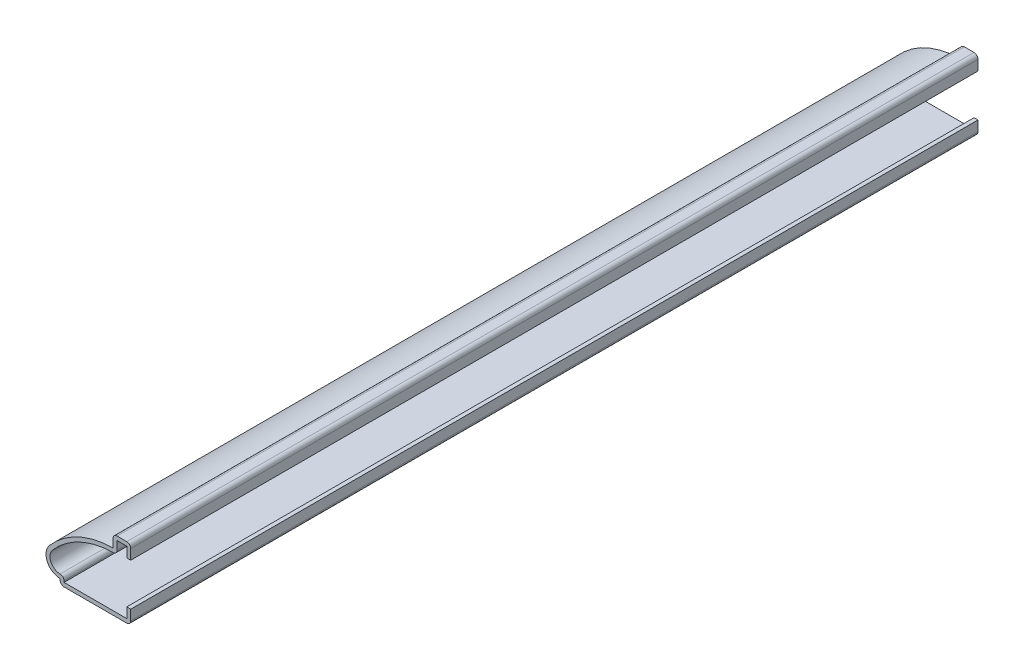
ISO-10303-21;
HEADER;
FILE_DESCRIPTION(('STEP AP214'),'2;1');
FILE_NAME('part.step','',(''),(''),'','','');
FILE_SCHEMA(('AUTOMOTIVE_DESIGN { 1 0 10303 214 1 1 1 1 }'));
ENDSEC;
DATA;
#1=APPLICATION_CONTEXT('core data for automotive mechanical design processes');
#2=APPLICATION_PROTOCOL_DEFINITION('international standard','automotive_design',2000,#1);
#3=PRODUCT_CONTEXT('',#1,'mechanical');
#4=PRODUCT('Part','Part','',(#3));
#5=PRODUCT_RELATED_PRODUCT_CATEGORY('part','',(#4));
#6=PRODUCT_DEFINITION_FORMATION('','',#4);
#7=PRODUCT_DEFINITION_CONTEXT('part definition',#1,'design');
#8=PRODUCT_DEFINITION('design','',#6,#7);
#9=PRODUCT_DEFINITION_SHAPE('','',#8);
#10=(LENGTH_UNIT() NAMED_UNIT(*) SI_UNIT(.MILLI.,.METRE.));
#11=(NAMED_UNIT(*) PLANE_ANGLE_UNIT() SI_UNIT($,.RADIAN.));
#12=(NAMED_UNIT(*) SI_UNIT($,.STERADIAN.) SOLID_ANGLE_UNIT());
#13=UNCERTAINTY_MEASURE_WITH_UNIT(LENGTH_MEASURE(1.E-05),#10,'distance_accuracy_value','');
#14=(GEOMETRIC_REPRESENTATION_CONTEXT(3) GLOBAL_UNCERTAINTY_ASSIGNED_CONTEXT((#13)) GLOBAL_UNIT_ASSIGNED_CONTEXT((#10,
#11,#12)) REPRESENTATION_CONTEXT('',''));
#15=CARTESIAN_POINT('',(0.,0.,0.));
#16=DIRECTION('',(0.,0.,1.));
#17=DIRECTION('',(1.,0.,0.));
#18=AXIS2_PLACEMENT_3D('',#15,#16,#17);
#19=CARTESIAN_POINT('',(-0.889,12.7,-190.5));
#20=DIRECTION('',(-1.,0.,0.));
#21=DIRECTION('',(0.,-1.,0.));
#22=AXIS2_PLACEMENT_3D('',#19,#20,#21);
#23=PLANE('',#22);
#24=DIRECTION('',(0.,-1.,0.));
#25=VECTOR('',#24,1.);
#26=CARTESIAN_POINT('',(-0.889,12.7,0.));
#27=LINE('',#26,#25);
#28=CARTESIAN_POINT('',(-0.889,11.811,0.));
#29=VERTEX_POINT('',#28);
#30=CARTESIAN_POINT('',(-0.888999999999999,9.525,0.));
#31=VERTEX_POINT('',#30);
#32=EDGE_CURVE('E264',#29,#31,#27,.T.);
#33=ORIENTED_EDGE('',*,*,#32,.F.);
#34=DIRECTION('',(0.,0.,1.));
#35=VECTOR('',#34,1.);
#36=CARTESIAN_POINT('',(-0.889,11.811,-190.5));
#37=LINE('',#36,#35);
#38=CARTESIAN_POINT('',(-0.889,11.811,-190.5));
#39=VERTEX_POINT('',#38);
#40=EDGE_CURVE('E221',#39,#29,#37,.T.);
#41=ORIENTED_EDGE('',*,*,#40,.F.);
#42=DIRECTION('',(0.,-1.,0.));
#43=VECTOR('',#42,1.);
#44=CARTESIAN_POINT('',(-0.889,12.7,-190.5));
#45=LINE('',#44,#43);
#46=CARTESIAN_POINT('',(-0.888999999999999,9.525,-190.5));
#47=VERTEX_POINT('',#46);
#48=EDGE_CURVE('E203',#39,#47,#45,.T.);
#49=ORIENTED_EDGE('',*,*,#48,.T.);
#50=DIRECTION('',(0.,0.,1.));
#51=VECTOR('',#50,1.);
#52=CARTESIAN_POINT('',(-0.888999999999999,9.525,-190.5));
#53=LINE('',#52,#51);
#54=EDGE_CURVE('E211',#47,#31,#53,.T.);
#55=ORIENTED_EDGE('',*,*,#54,.T.);
#56=EDGE_LOOP('',(#33,#41,#49,#55));
#57=FACE_BOUND('',#56,.T.);
#58=ADVANCED_FACE('F35',(#57),#23,.T.);
#59=CARTESIAN_POINT('',(-3.96875,11.811,-190.5));
#60=DIRECTION('',(0.,-1.,0.));
#61=DIRECTION('',(0.,0.,-1.));
#62=AXIS2_PLACEMENT_3D('',#59,#60,#61);
#63=PLANE('',#62);
#64=DIRECTION('',(1.,0.,0.));
#65=VECTOR('',#64,1.);
#66=CARTESIAN_POINT('',(-3.96875,11.811,0.));
#67=LINE('',#66,#65);
#68=CARTESIAN_POINT('',(-3.07975,11.811,0.));
#69=VERTEX_POINT('',#68);
#70=EDGE_CURVE('E222',#69,#29,#67,.T.);
#71=ORIENTED_EDGE('',*,*,#70,.F.);
#72=DIRECTION('',(0.,0.,1.));
#73=VECTOR('',#72,1.);
#74=CARTESIAN_POINT('',(-3.07975,11.811,-190.5));
#75=LINE('',#74,#73);
#76=CARTESIAN_POINT('',(-3.07975,11.811,-190.5));
#77=VERTEX_POINT('',#76);
#78=EDGE_CURVE('E305',#77,#69,#75,.T.);
#79=ORIENTED_EDGE('',*,*,#78,.F.);
#80=DIRECTION('',(1.,0.,0.));
#81=VECTOR('',#80,1.);
#82=CARTESIAN_POINT('',(-3.96875,11.811,-190.5));
#83=LINE('',#82,#81);
#84=EDGE_CURVE('E219',#77,#39,#83,.T.);
#85=ORIENTED_EDGE('',*,*,#84,.T.);
#86=ORIENTED_EDGE('',*,*,#40,.T.);
#87=EDGE_LOOP('',(#71,#79,#85,#86));
#88=FACE_BOUND('',#87,.T.);
#89=ADVANCED_FACE('F400',(#88),#63,.T.);
#90=CARTESIAN_POINT('',(-3.07975,9.921875,-190.5));
#91=DIRECTION('',(1.,0.,0.));
#92=DIRECTION('',(0.,0.,-1.));
#93=AXIS2_PLACEMENT_3D('',#90,#91,#92);
#94=PLANE('',#93);
#95=DIRECTION('',(0.,1.,0.));
#96=VECTOR('',#95,1.);
#97=CARTESIAN_POINT('',(-3.07975,9.921875,0.));
#98=LINE('',#97,#96);
#99=CARTESIAN_POINT('',(-3.07975,9.92187500000001,0.));
#100=VERTEX_POINT('',#99);
#101=EDGE_CURVE('E225',#100,#69,#98,.T.);
#102=ORIENTED_EDGE('',*,*,#101,.F.);
#103=DIRECTION('',(0.,0.,1.));
#104=VECTOR('',#103,1.);
#105=CARTESIAN_POINT('',(-3.07975,9.921875,-190.5));
#106=LINE('',#105,#104);
#107=CARTESIAN_POINT('',(-3.07975,9.92187500000001,-190.5));
#108=VERTEX_POINT('',#107);
#109=EDGE_CURVE('E370',#100,#108,#106,.F.);
#110=ORIENTED_EDGE('',*,*,#109,.T.);
#111=DIRECTION('',(0.,1.,0.));
#112=VECTOR('',#111,1.);
#113=CARTESIAN_POINT('',(-3.07975,9.921875,-190.5));
#114=LINE('',#113,#112);
#115=EDGE_CURVE('E261',#108,#77,#114,.T.);
#116=ORIENTED_EDGE('',*,*,#115,.T.);
#117=ORIENTED_EDGE('',*,*,#78,.T.);
#118=EDGE_LOOP('',(#102,#110,#116,#117));
#119=FACE_BOUND('',#118,.T.);
#120=ADVANCED_FACE('F481',(#119),#94,.T.);
#121=CARTESIAN_POINT('',(-3.81048213585267,-9.12746754201909,-190.5));
#122=DIRECTION('',(0.,0.,1.));
#123=DIRECTION('',(1.,0.,0.));
#124=AXIS2_PLACEMENT_3D('',#121,#122,#123);
#125=CYLINDRICAL_SURFACE('',#124,18.161);
#126=CARTESIAN_POINT('',(-3.81048213585267,-9.12746754201909,-190.5));
#127=DIRECTION('',(0.,0.,1.));
#128=DIRECTION('',(1.,0.,0.));
#129=AXIS2_PLACEMENT_3D('',#126,#127,#128);
#130=CIRCLE('',#129,18.161);
#131=CARTESIAN_POINT('',(-17.6122905724372,2.67643032605075,-190.5));
#132=VERTEX_POINT('',#131);
#133=CARTESIAN_POINT('',(-3.96136416633979,9.03290568137245,-190.5));
#134=VERTEX_POINT('',#133);
#135=EDGE_CURVE('E258',#132,#134,#130,.F.);
#136=ORIENTED_EDGE('',*,*,#135,.T.);
#137=DIRECTION('',(0.,0.,1.));
#138=VECTOR('',#137,1.);
#139=CARTESIAN_POINT('',(-3.96136416633979,9.03290568137245,-190.5));
#140=LINE('',#139,#138);
#141=CARTESIAN_POINT('',(-3.96136416633979,9.03290568137245,0.));
#142=VERTEX_POINT('',#141);
#143=EDGE_CURVE('E367',#134,#142,#140,.T.);
#144=ORIENTED_EDGE('',*,*,#143,.T.);
#145=CARTESIAN_POINT('',(-3.81048213585267,-9.12746754201909,0.));
#146=DIRECTION('',(0.,0.,1.));
#147=DIRECTION('',(1.,0.,0.));
#148=AXIS2_PLACEMENT_3D('',#145,#146,#147);
#149=CIRCLE('',#148,18.161);
#150=CARTESIAN_POINT('',(-17.6122905724372,2.67643032605075,0.));
#151=VERTEX_POINT('',#150);
#152=EDGE_CURVE('E299',#151,#142,#149,.F.);
#153=ORIENTED_EDGE('',*,*,#152,.F.);
#154=DIRECTION('',(0.,0.,1.));
#155=VECTOR('',#154,1.);
#156=CARTESIAN_POINT('',(-17.6122905724372,2.67643032605075,-190.5));
#157=LINE('',#156,#155);
#158=EDGE_CURVE('E308',#132,#151,#157,.T.);
#159=ORIENTED_EDGE('',*,*,#158,.F.);
#160=EDGE_LOOP('',(#136,#144,#153,#159));
#161=FACE_BOUND('',#160,.T.);
#162=ADVANCED_FACE('F411',(#161),#125,.F.);
#163=CARTESIAN_POINT('',(-15.875,1.190625,-190.5));
#164=DIRECTION('',(0.,0.,1.));
#165=DIRECTION('',(1.,0.,0.));
#166=AXIS2_PLACEMENT_3D('',#163,#164,#165);
#167=CYLINDRICAL_SURFACE('',#166,2.286);
#168=CARTESIAN_POINT('',(-15.875,1.190625,0.));
#169=DIRECTION('',(0.,0.,1.));
#170=DIRECTION('',(1.,0.,0.));
#171=AXIS2_PLACEMENT_3D('',#168,#169,#170);
#172=CIRCLE('',#171,2.286);
#173=CARTESIAN_POINT('',(-15.875,-1.09537500000001,0.));
#174=VERTEX_POINT('',#173);
#175=EDGE_CURVE('E297',#174,#151,#172,.F.);
#176=ORIENTED_EDGE('',*,*,#175,.F.);
#177=DIRECTION('',(0.,0.,1.));
#178=VECTOR('',#177,1.);
#179=CARTESIAN_POINT('',(-15.875,-1.09537500000001,-190.5));
#180=LINE('',#179,#178);
#181=CARTESIAN_POINT('',(-15.875,-1.09537500000001,-190.5));
#182=VERTEX_POINT('',#181);
#183=EDGE_CURVE('E365',#174,#182,#180,.F.);
#184=ORIENTED_EDGE('',*,*,#183,.T.);
#185=CARTESIAN_POINT('',(-15.875,1.190625,-190.5));
#186=DIRECTION('',(0.,0.,1.));
#187=DIRECTION('',(1.,0.,0.));
#188=AXIS2_PLACEMENT_3D('',#185,#186,#187);
#189=CIRCLE('',#188,2.286);
#190=EDGE_CURVE('E256',#182,#132,#189,.F.);
#191=ORIENTED_EDGE('',*,*,#190,.T.);
#192=ORIENTED_EDGE('',*,*,#158,.T.);
#193=EDGE_LOOP('',(#176,#184,#191,#192));
#194=FACE_BOUND('',#193,.T.);
#195=ADVANCED_FACE('F416',(#194),#167,.F.);
#196=CARTESIAN_POINT('',(-14.986,-3.175,-190.5));
#197=DIRECTION('',(1.,0.,0.));
#198=DIRECTION('',(0.,0.,-1.));
#199=AXIS2_PLACEMENT_3D('',#196,#197,#198);
#200=PLANE('',#199);
#201=DIRECTION('',(0.,1.,0.));
#202=VECTOR('',#201,1.);
#203=CARTESIAN_POINT('',(-14.986,-3.175,-190.5));
#204=LINE('',#203,#202);
#205=CARTESIAN_POINT('',(-14.986,-2.286,-190.5));
#206=VERTEX_POINT('',#205);
#207=CARTESIAN_POINT('',(-14.986,-1.98437500000001,-190.5));
#208=VERTEX_POINT('',#207);
#209=EDGE_CURVE('E253',#206,#208,#204,.T.);
#210=ORIENTED_EDGE('',*,*,#209,.T.);
#211=DIRECTION('',(0.,0.,1.));
#212=VECTOR('',#211,1.);
#213=CARTESIAN_POINT('',(-14.986,-1.98437500000001,-190.5));
#214=LINE('',#213,#212);
#215=CARTESIAN_POINT('',(-14.986,-1.98437500000001,0.));
#216=VERTEX_POINT('',#215);
#217=EDGE_CURVE('E362',#208,#216,#214,.T.);
#218=ORIENTED_EDGE('',*,*,#217,.T.);
#219=DIRECTION('',(0.,1.,0.));
#220=VECTOR('',#219,1.);
#221=CARTESIAN_POINT('',(-14.986,-3.175,0.));
#222=LINE('',#221,#220);
#223=CARTESIAN_POINT('',(-14.986,-2.286,0.));
#224=VERTEX_POINT('',#223);
#225=EDGE_CURVE('E294',#224,#216,#222,.T.);
#226=ORIENTED_EDGE('',*,*,#225,.F.);
#227=DIRECTION('',(0.,0.,1.));
#228=VECTOR('',#227,1.);
#229=CARTESIAN_POINT('',(-14.986,-2.286,-190.5));
#230=LINE('',#229,#228);
#231=EDGE_CURVE('E311',#206,#224,#230,.T.);
#232=ORIENTED_EDGE('',*,*,#231,.F.);
#233=EDGE_LOOP('',(#210,#218,#226,#232));
#234=FACE_BOUND('',#233,.T.);
#235=ADVANCED_FACE('F425',(#234),#200,.T.);
#236=CARTESIAN_POINT('',(0.,-2.286,-190.5));
#237=DIRECTION('',(0.,1.,0.));
#238=DIRECTION('',(-1.,0.,0.));
#239=AXIS2_PLACEMENT_3D('',#236,#237,#238);
#240=PLANE('',#239);
#241=DIRECTION('',(-1.,0.,0.));
#242=VECTOR('',#241,1.);
#243=CARTESIAN_POINT('',(0.,-2.286,0.));
#244=LINE('',#243,#242);
#245=CARTESIAN_POINT('',(-0.889,-2.286,0.));
#246=VERTEX_POINT('',#245);
#247=EDGE_CURVE('E291',#246,#224,#244,.T.);
#248=ORIENTED_EDGE('',*,*,#247,.F.);
#249=DIRECTION('',(0.,0.,1.));
#250=VECTOR('',#249,1.);
#251=CARTESIAN_POINT('',(-0.889,-2.286,-190.5));
#252=LINE('',#251,#250);
#253=CARTESIAN_POINT('',(-0.889,-2.286,-190.5));
#254=VERTEX_POINT('',#253);
#255=EDGE_CURVE('E313',#254,#246,#252,.T.);
#256=ORIENTED_EDGE('',*,*,#255,.F.);
#257=DIRECTION('',(-1.,0.,0.));
#258=VECTOR('',#257,1.);
#259=CARTESIAN_POINT('',(0.,-2.286,-190.5));
#260=LINE('',#259,#258);
#261=EDGE_CURVE('E250',#254,#206,#260,.T.);
#262=ORIENTED_EDGE('',*,*,#261,.T.);
#263=ORIENTED_EDGE('',*,*,#231,.T.);
#264=EDGE_LOOP('',(#248,#256,#262,#263));
#265=FACE_BOUND('',#264,.T.);
#266=ADVANCED_FACE('F430',(#265),#240,.T.);
#267=CARTESIAN_POINT('',(-0.889,0.,-190.5));
#268=DIRECTION('',(-1.,0.,0.));
#269=DIRECTION('',(0.,0.,1.));
#270=AXIS2_PLACEMENT_3D('',#267,#268,#269);
#271=PLANE('',#270);
#272=DIRECTION('',(0.,1.,0.));
#273=VECTOR('',#272,1.);
#274=CARTESIAN_POINT('',(-0.889,0.,0.));
#275=LINE('',#274,#273);
#276=CARTESIAN_POINT('',(-0.889,0.,0.));
#277=VERTEX_POINT('',#276);
#278=EDGE_CURVE('E288',#277,#246,#275,.F.);
#279=ORIENTED_EDGE('',*,*,#278,.F.);
#280=DIRECTION('',(0.,0.,1.));
#281=VECTOR('',#280,1.);
#282=CARTESIAN_POINT('',(-0.889,0.,-190.5));
#283=LINE('',#282,#281);
#284=CARTESIAN_POINT('',(-0.889,0.,-190.5));
#285=VERTEX_POINT('',#284);
#286=EDGE_CURVE('E315',#285,#277,#283,.T.);
#287=ORIENTED_EDGE('',*,*,#286,.F.);
#288=DIRECTION('',(0.,1.,0.));
#289=VECTOR('',#288,1.);
#290=CARTESIAN_POINT('',(-0.889,0.,-190.5));
#291=LINE('',#290,#289);
#292=EDGE_CURVE('E247',#285,#254,#291,.F.);
#293=ORIENTED_EDGE('',*,*,#292,.T.);
#294=ORIENTED_EDGE('',*,*,#255,.T.);
#295=EDGE_LOOP('',(#279,#287,#293,#294));
#296=FACE_BOUND('',#295,.T.);
#297=ADVANCED_FACE('F434',(#296),#271,.T.);
#298=CARTESIAN_POINT('',(-0.889,0.,-190.5));
#299=DIRECTION('',(0.,-1.,0.));
#300=DIRECTION('',(0.,0.,-1.));
#301=AXIS2_PLACEMENT_3D('',#298,#299,#300);
#302=PLANE('',#301);
#303=DIRECTION('',(1.,0.,0.));
#304=VECTOR('',#303,1.);
#305=CARTESIAN_POINT('',(-0.889,0.,0.));
#306=LINE('',#305,#304);
#307=CARTESIAN_POINT('',(0.,0.,0.));
#308=VERTEX_POINT('',#307);
#309=EDGE_CURVE('E286',#277,#308,#306,.T.);
#310=ORIENTED_EDGE('',*,*,#309,.T.);
#311=DIRECTION('',(0.,0.,1.));
#312=VECTOR('',#311,1.);
#313=CARTESIAN_POINT('',(0.,0.,-190.5));
#314=LINE('',#313,#312);
#315=CARTESIAN_POINT('',(0.,0.,-190.5));
#316=VERTEX_POINT('',#315);
#317=EDGE_CURVE('E317',#316,#308,#314,.T.);
#318=ORIENTED_EDGE('',*,*,#317,.F.);
#319=DIRECTION('',(1.,0.,0.));
#320=VECTOR('',#319,1.);
#321=CARTESIAN_POINT('',(-0.889,0.,-190.5));
#322=LINE('',#321,#320);
#323=EDGE_CURVE('E245',#285,#316,#322,.T.);
#324=ORIENTED_EDGE('',*,*,#323,.F.);
#325=ORIENTED_EDGE('',*,*,#286,.T.);
#326=EDGE_LOOP('',(#310,#318,#324,#325));
#327=FACE_BOUND('',#326,.T.);
#328=ADVANCED_FACE('F438',(#327),#302,.F.);
#329=CARTESIAN_POINT('',(0.,0.,-190.5));
#330=DIRECTION('',(-1.,0.,0.));
#331=DIRECTION('',(0.,0.,1.));
#332=AXIS2_PLACEMENT_3D('',#329,#330,#331);
#333=PLANE('',#332);
#334=DIRECTION('',(0.,-1.,0.));
#335=VECTOR('',#334,1.);
#336=CARTESIAN_POINT('',(0.,0.,0.));
#337=LINE('',#336,#335);
#338=CARTESIAN_POINT('',(0.,-2.286,0.));
#339=VERTEX_POINT('',#338);
#340=EDGE_CURVE('E283',#308,#339,#337,.T.);
#341=ORIENTED_EDGE('',*,*,#340,.T.);
#342=DIRECTION('',(0.,0.,1.));
#343=VECTOR('',#342,1.);
#344=CARTESIAN_POINT('',(0.,-2.286,-190.5));
#345=LINE('',#344,#343);
#346=CARTESIAN_POINT('',(0.,-2.286,-190.5));
#347=VERTEX_POINT('',#346);
#348=EDGE_CURVE('E346',#339,#347,#345,.F.);
#349=ORIENTED_EDGE('',*,*,#348,.T.);
#350=DIRECTION('',(0.,-1.,0.));
#351=VECTOR('',#350,1.);
#352=CARTESIAN_POINT('',(0.,0.,-190.5));
#353=LINE('',#352,#351);
#354=EDGE_CURVE('E243',#316,#347,#353,.T.);
#355=ORIENTED_EDGE('',*,*,#354,.F.);
#356=ORIENTED_EDGE('',*,*,#317,.T.);
#357=EDGE_LOOP('',(#341,#349,#355,#356));
#358=FACE_BOUND('',#357,.T.);
#359=ADVANCED_FACE('F586',(#358),#333,.F.);
#360=CARTESIAN_POINT('',(0.,-3.175,-190.5));
#361=DIRECTION('',(0.,1.,0.));
#362=DIRECTION('',(-1.,0.,0.));
#363=AXIS2_PLACEMENT_3D('',#360,#361,#362);
#364=PLANE('',#363);
#365=DIRECTION('',(-1.,0.,0.));
#366=VECTOR('',#365,1.);
#367=CARTESIAN_POINT('',(0.,-3.175,-190.5));
#368=LINE('',#367,#366);
#369=CARTESIAN_POINT('',(-0.889,-3.175,-190.5));
#370=VERTEX_POINT('',#369);
#371=CARTESIAN_POINT('',(-14.986,-3.175,-190.5));
#372=VERTEX_POINT('',#371);
#373=EDGE_CURVE('E240',#370,#372,#368,.T.);
#374=ORIENTED_EDGE('',*,*,#373,.F.);
#375=DIRECTION('',(0.,0.,1.));
#376=VECTOR('',#375,1.);
#377=CARTESIAN_POINT('',(-0.889,-3.175,-190.5));
#378=LINE('',#377,#376);
#379=CARTESIAN_POINT('',(-0.889,-3.175,0.));
#380=VERTEX_POINT('',#379);
#381=EDGE_CURVE('E331',#370,#380,#378,.T.);
#382=ORIENTED_EDGE('',*,*,#381,.T.);
#383=DIRECTION('',(-1.,0.,0.));
#384=VECTOR('',#383,1.);
#385=CARTESIAN_POINT('',(0.,-3.175,0.));
#386=LINE('',#385,#384);
#387=CARTESIAN_POINT('',(-14.986,-3.175,0.));
#388=VERTEX_POINT('',#387);
#389=EDGE_CURVE('E280',#380,#388,#386,.T.);
#390=ORIENTED_EDGE('',*,*,#389,.T.);
#391=DIRECTION('',(0.,0.,1.));
#392=VECTOR('',#391,1.);
#393=CARTESIAN_POINT('',(-14.986,-3.175,-190.5));
#394=LINE('',#393,#392);
#395=EDGE_CURVE('E304',#388,#372,#394,.F.);
#396=ORIENTED_EDGE('',*,*,#395,.T.);
#397=EDGE_LOOP('',(#374,#382,#390,#396));
#398=FACE_BOUND('',#397,.T.);
#399=ADVANCED_FACE('F448',(#398),#364,.F.);
#400=CARTESIAN_POINT('',(-15.875,-3.175,-190.5));
#401=DIRECTION('',(1.,0.,0.));
#402=DIRECTION('',(0.,0.,-1.));
#403=AXIS2_PLACEMENT_3D('',#400,#401,#402);
#404=PLANE('',#403);
#405=DIRECTION('',(0.,1.,0.));
#406=VECTOR('',#405,1.);
#407=CARTESIAN_POINT('',(-15.875,-3.175,-190.5));
#408=LINE('',#407,#406);
#409=CARTESIAN_POINT('',(-15.875,-2.286,-190.5));
#410=VERTEX_POINT('',#409);
#411=CARTESIAN_POINT('',(-15.875,-1.984375,-190.5));
#412=VERTEX_POINT('',#411);
#413=EDGE_CURVE('E238',#410,#412,#408,.T.);
#414=ORIENTED_EDGE('',*,*,#413,.F.);
#415=DIRECTION('',(0.,0.,1.));
#416=VECTOR('',#415,1.);
#417=CARTESIAN_POINT('',(-15.875,-2.286,-190.5));
#418=LINE('',#417,#416);
#419=CARTESIAN_POINT('',(-15.875,-2.286,0.));
#420=VERTEX_POINT('',#419);
#421=EDGE_CURVE('E359',#410,#420,#418,.T.);
#422=ORIENTED_EDGE('',*,*,#421,.T.);
#423=DIRECTION('',(0.,1.,0.));
#424=VECTOR('',#423,1.);
#425=CARTESIAN_POINT('',(-15.875,-3.175,0.));
#426=LINE('',#425,#424);
#427=CARTESIAN_POINT('',(-15.875,-1.984375,0.));
#428=VERTEX_POINT('',#427);
#429=EDGE_CURVE('E278',#420,#428,#426,.T.);
#430=ORIENTED_EDGE('',*,*,#429,.T.);
#431=DIRECTION('',(0.,0.,1.));
#432=VECTOR('',#431,1.);
#433=CARTESIAN_POINT('',(-15.875,-1.984375,-190.5));
#434=LINE('',#433,#432);
#435=EDGE_CURVE('E320',#412,#428,#434,.T.);
#436=ORIENTED_EDGE('',*,*,#435,.F.);
#437=EDGE_LOOP('',(#414,#422,#430,#436));
#438=FACE_BOUND('',#437,.T.);
#439=ADVANCED_FACE('F459',(#438),#404,.F.);
#440=CARTESIAN_POINT('',(-15.875,1.190625,-190.5));
#441=DIRECTION('',(0.,0.,1.));
#442=DIRECTION('',(1.,0.,0.));
#443=AXIS2_PLACEMENT_3D('',#440,#441,#442);
#444=CYLINDRICAL_SURFACE('',#443,3.175);
#445=CARTESIAN_POINT('',(-15.875,1.190625,0.));
#446=DIRECTION('',(0.,0.,-1.));
#447=DIRECTION('',(-1.,0.,0.));
#448=AXIS2_PLACEMENT_3D('',#445,#446,#447);
#449=CIRCLE('',#448,3.175);
#450=CARTESIAN_POINT('',(-18.2879035728295,3.25424350840382,0.));
#451=VERTEX_POINT('',#450);
#452=EDGE_CURVE('E276',#428,#451,#449,.T.);
#453=ORIENTED_EDGE('',*,*,#452,.T.);
#454=DIRECTION('',(0.,0.,1.));
#455=VECTOR('',#454,1.);
#456=CARTESIAN_POINT('',(-18.2879035728295,3.25424350840382,-190.5));
#457=LINE('',#456,#455);
#458=CARTESIAN_POINT('',(-18.2879035728295,3.25424350840382,-190.5));
#459=VERTEX_POINT('',#458);
#460=EDGE_CURVE('E323',#459,#451,#457,.T.);
#461=ORIENTED_EDGE('',*,*,#460,.F.);
#462=CARTESIAN_POINT('',(-15.875,1.190625,-190.5));
#463=DIRECTION('',(0.,0.,-1.));
#464=DIRECTION('',(-1.,0.,0.));
#465=AXIS2_PLACEMENT_3D('',#462,#463,#464);
#466=CIRCLE('',#465,3.175);
#467=EDGE_CURVE('E236',#412,#459,#466,.T.);
#468=ORIENTED_EDGE('',*,*,#467,.F.);
#469=ORIENTED_EDGE('',*,*,#435,.T.);
#470=EDGE_LOOP('',(#453,#461,#468,#469));
#471=FACE_BOUND('',#470,.T.);
#472=ADVANCED_FACE('F464',(#471),#444,.T.);
#473=CARTESIAN_POINT('',(-3.81048213585267,-9.12746754201909,-190.5));
#474=DIRECTION('',(0.,0.,1.));
#475=DIRECTION('',(1.,0.,0.));
#476=AXIS2_PLACEMENT_3D('',#473,#474,#475);
#477=CYLINDRICAL_SURFACE('',#476,19.05);
#478=CARTESIAN_POINT('',(-3.81048213585267,-9.12746754201909,0.));
#479=DIRECTION('',(0.,0.,-1.));
#480=DIRECTION('',(-1.,0.,0.));
#481=AXIS2_PLACEMENT_3D('',#478,#479,#480);
#482=CIRCLE('',#481,19.05);
#483=CARTESIAN_POINT('',(-3.96875,9.921875,0.));
#484=VERTEX_POINT('',#483);
#485=EDGE_CURVE('E274',#451,#484,#482,.T.);
#486=ORIENTED_EDGE('',*,*,#485,.T.);
#487=DIRECTION('',(0.,0.,1.));
#488=VECTOR('',#487,1.);
#489=CARTESIAN_POINT('',(-3.96875,9.921875,-190.5));
#490=LINE('',#489,#488);
#491=CARTESIAN_POINT('',(-3.96875,9.921875,-190.5));
#492=VERTEX_POINT('',#491);
#493=EDGE_CURVE('E326',#492,#484,#490,.T.);
#494=ORIENTED_EDGE('',*,*,#493,.F.);
#495=CARTESIAN_POINT('',(-3.81048213585267,-9.12746754201909,-190.5));
#496=DIRECTION('',(0.,0.,-1.));
#497=DIRECTION('',(-1.,0.,0.));
#498=AXIS2_PLACEMENT_3D('',#495,#496,#497);
#499=CIRCLE('',#498,19.05);
#500=EDGE_CURVE('E234',#459,#492,#499,.T.);
#501=ORIENTED_EDGE('',*,*,#500,.F.);
#502=ORIENTED_EDGE('',*,*,#460,.T.);
#503=EDGE_LOOP('',(#486,#494,#501,#502));
#504=FACE_BOUND('',#503,.T.);
#505=ADVANCED_FACE('F467',(#504),#477,.T.);
#506=CARTESIAN_POINT('',(-3.96875,9.921875,-190.5));
#507=DIRECTION('',(1.,0.,0.));
#508=DIRECTION('',(0.,0.,-1.));
#509=AXIS2_PLACEMENT_3D('',#506,#507,#508);
#510=PLANE('',#509);
#511=DIRECTION('',(0.,1.,0.));
#512=VECTOR('',#511,1.);
#513=CARTESIAN_POINT('',(-3.96875,9.921875,0.));
#514=LINE('',#513,#512);
#515=CARTESIAN_POINT('',(-3.96875,11.811,0.));
#516=VERTEX_POINT('',#515);
#517=EDGE_CURVE('E271',#484,#516,#514,.T.);
#518=ORIENTED_EDGE('',*,*,#517,.T.);
#519=DIRECTION('',(0.,0.,1.));
#520=VECTOR('',#519,1.);
#521=CARTESIAN_POINT('',(-3.96875,11.811,-190.5));
#522=LINE('',#521,#520);
#523=CARTESIAN_POINT('',(-3.96875,11.811,-190.5));
#524=VERTEX_POINT('',#523);
#525=EDGE_CURVE('E43',#516,#524,#522,.F.);
#526=ORIENTED_EDGE('',*,*,#525,.T.);
#527=DIRECTION('',(0.,1.,0.));
#528=VECTOR('',#527,1.);
#529=CARTESIAN_POINT('',(-3.96875,9.921875,-190.5));
#530=LINE('',#529,#528);
#531=EDGE_CURVE('E231',#492,#524,#530,.T.);
#532=ORIENTED_EDGE('',*,*,#531,.F.);
#533=ORIENTED_EDGE('',*,*,#493,.T.);
#534=EDGE_LOOP('',(#518,#526,#532,#533));
#535=FACE_BOUND('',#534,.T.);
#536=ADVANCED_FACE('F378',(#535),#510,.F.);
#537=CARTESIAN_POINT('',(-3.96875,12.7,-190.5));
#538=DIRECTION('',(0.,-1.,0.));
#539=DIRECTION('',(0.,0.,-1.));
#540=AXIS2_PLACEMENT_3D('',#537,#538,#539);
#541=PLANE('',#540);
#542=DIRECTION('',(1.,0.,0.));
#543=VECTOR('',#542,1.);
#544=CARTESIAN_POINT('',(-3.96875,12.7,-190.5));
#545=LINE('',#544,#543);
#546=CARTESIAN_POINT('',(-3.07975,12.7,-190.5));
#547=VERTEX_POINT('',#546);
#548=CARTESIAN_POINT('',(-0.889,12.7,-190.5));
#549=VERTEX_POINT('',#548);
#550=EDGE_CURVE('E229',#547,#549,#545,.T.);
#551=ORIENTED_EDGE('',*,*,#550,.F.);
#552=DIRECTION('',(0.,0.,1.));
#553=VECTOR('',#552,1.);
#554=CARTESIAN_POINT('',(-3.07975,12.7,-190.5));
#555=LINE('',#554,#553);
#556=CARTESIAN_POINT('',(-3.07975,12.7,0.));
#557=VERTEX_POINT('',#556);
#558=EDGE_CURVE('E373',#547,#557,#555,.T.);
#559=ORIENTED_EDGE('',*,*,#558,.T.);
#560=DIRECTION('',(1.,0.,0.));
#561=VECTOR('',#560,1.);
#562=CARTESIAN_POINT('',(-3.96875,12.7,0.));
#563=LINE('',#562,#561);
#564=CARTESIAN_POINT('',(-0.889,12.7,0.));
#565=VERTEX_POINT('',#564);
#566=EDGE_CURVE('E269',#557,#565,#563,.T.);
#567=ORIENTED_EDGE('',*,*,#566,.T.);
#568=DIRECTION('',(0.,0.,1.));
#569=VECTOR('',#568,1.);
#570=CARTESIAN_POINT('',(-0.889,12.7,-190.5));
#571=LINE('',#570,#569);
#572=EDGE_CURVE('E58',#565,#549,#571,.F.);
#573=ORIENTED_EDGE('',*,*,#572,.T.);
#574=EDGE_LOOP('',(#551,#559,#567,#573));
#575=FACE_BOUND('',#574,.T.);
#576=ADVANCED_FACE('F387',(#575),#541,.F.);
#577=CARTESIAN_POINT('',(0.,12.7,-190.5));
#578=DIRECTION('',(-1.,0.,0.));
#579=DIRECTION('',(0.,-1.,0.));
#580=AXIS2_PLACEMENT_3D('',#577,#578,#579);
#581=PLANE('',#580);
#582=DIRECTION('',(0.,-1.,0.));
#583=VECTOR('',#582,1.);
#584=CARTESIAN_POINT('',(0.,12.7,-190.5));
#585=LINE('',#584,#583);
#586=CARTESIAN_POINT('',(0.,11.811,-190.5));
#587=VERTEX_POINT('',#586);
#588=CARTESIAN_POINT('',(0.,9.525,-190.5));
#589=VERTEX_POINT('',#588);
#590=EDGE_CURVE('E205',#587,#589,#585,.T.);
#591=ORIENTED_EDGE('',*,*,#590,.F.);
#592=DIRECTION('',(0.,0.,1.));
#593=VECTOR('',#592,1.);
#594=CARTESIAN_POINT('',(0.,11.811,-190.5));
#595=LINE('',#594,#593);
#596=CARTESIAN_POINT('',(0.,11.811,0.));
#597=VERTEX_POINT('',#596);
#598=EDGE_CURVE('E11',#587,#597,#595,.T.);
#599=ORIENTED_EDGE('',*,*,#598,.T.);
#600=DIRECTION('',(0.,-1.,0.));
#601=VECTOR('',#600,1.);
#602=CARTESIAN_POINT('',(0.,12.7,0.));
#603=LINE('',#602,#601);
#604=CARTESIAN_POINT('',(0.,9.525,0.));
#605=VERTEX_POINT('',#604);
#606=EDGE_CURVE('E267',#597,#605,#603,.T.);
#607=ORIENTED_EDGE('',*,*,#606,.T.);
#608=DIRECTION('',(0.,0.,1.));
#609=VECTOR('',#608,1.);
#610=CARTESIAN_POINT('',(0.,9.525,-190.5));
#611=LINE('',#610,#609);
#612=EDGE_CURVE('E218',#589,#605,#611,.T.);
#613=ORIENTED_EDGE('',*,*,#612,.F.);
#614=EDGE_LOOP('',(#591,#599,#607,#613));
#615=FACE_BOUND('',#614,.T.);
#616=ADVANCED_FACE('F395',(#615),#581,.F.);
#617=CARTESIAN_POINT('',(0.,9.525,-190.5));
#618=DIRECTION('',(0.,1.,0.));
#619=DIRECTION('',(0.,0.,1.));
#620=AXIS2_PLACEMENT_3D('',#617,#618,#619);
#621=PLANE('',#620);
#622=DIRECTION('',(-1.,0.,0.));
#623=VECTOR('',#622,1.);
#624=CARTESIAN_POINT('',(0.,9.525,0.));
#625=LINE('',#624,#623);
#626=EDGE_CURVE('E214',#605,#31,#625,.T.);
#627=ORIENTED_EDGE('',*,*,#626,.T.);
#628=ORIENTED_EDGE('',*,*,#54,.F.);
#629=DIRECTION('',(-1.,0.,0.));
#630=VECTOR('',#629,1.);
#631=CARTESIAN_POINT('',(0.,9.525,-190.5));
#632=LINE('',#631,#630);
#633=EDGE_CURVE('E197',#589,#47,#632,.T.);
#634=ORIENTED_EDGE('',*,*,#633,.F.);
#635=ORIENTED_EDGE('',*,*,#612,.T.);
#636=EDGE_LOOP('',(#627,#628,#634,#635));
#637=FACE_BOUND('',#636,.T.);
#638=ADVANCED_FACE('F212',(#637),#621,.F.);
#639=CARTESIAN_POINT('',(-3.81048213585267,-9.12746754201909,-190.5));
#640=DIRECTION('',(0.,0.,-1.));
#641=DIRECTION('',(-1.,0.,0.));
#642=AXIS2_PLACEMENT_3D('',#639,#640,#641);
#643=PLANE('',#642);
#644=ORIENTED_EDGE('',*,*,#354,.T.);
#645=CARTESIAN_POINT('',(-0.889,-2.286,-190.5));
#646=DIRECTION('',(0.,0.,-1.));
#647=DIRECTION('',(-1.,0.,0.));
#648=AXIS2_PLACEMENT_3D('',#645,#646,#647);
#649=CIRCLE('',#648,0.889);
#650=EDGE_CURVE('E357',#347,#370,#649,.T.);
#651=ORIENTED_EDGE('',*,*,#650,.T.);
#652=ORIENTED_EDGE('',*,*,#373,.T.);
#653=CARTESIAN_POINT('',(-14.986,-2.286,-190.5));
#654=DIRECTION('',(0.,0.,-1.));
#655=DIRECTION('',(-1.,0.,0.));
#656=AXIS2_PLACEMENT_3D('',#653,#654,#655);
#657=CIRCLE('',#656,0.889);
#658=EDGE_CURVE('E355',#372,#410,#657,.T.);
#659=ORIENTED_EDGE('',*,*,#658,.T.);
#660=ORIENTED_EDGE('',*,*,#413,.T.);
#661=ORIENTED_EDGE('',*,*,#467,.T.);
#662=ORIENTED_EDGE('',*,*,#500,.T.);
#663=ORIENTED_EDGE('',*,*,#531,.T.);
#664=CARTESIAN_POINT('',(-3.07975,11.811,-190.5));
#665=DIRECTION('',(0.,0.,-1.));
#666=DIRECTION('',(-1.,0.,0.));
#667=AXIS2_PLACEMENT_3D('',#664,#665,#666);
#668=CIRCLE('',#667,0.889);
#669=EDGE_CURVE('E349',#524,#547,#668,.T.);
#670=ORIENTED_EDGE('',*,*,#669,.T.);
#671=ORIENTED_EDGE('',*,*,#550,.T.);
#672=CARTESIAN_POINT('',(-0.889,11.811,-190.5));
#673=DIRECTION('',(0.,0.,-1.));
#674=DIRECTION('',(-1.,0.,0.));
#675=AXIS2_PLACEMENT_3D('',#672,#673,#674);
#676=CIRCLE('',#675,0.889);
#677=EDGE_CURVE('E50',#549,#587,#676,.T.);
#678=ORIENTED_EDGE('',*,*,#677,.T.);
#679=ORIENTED_EDGE('',*,*,#590,.T.);
#680=ORIENTED_EDGE('',*,*,#633,.T.);
#681=ORIENTED_EDGE('',*,*,#48,.F.);
#682=ORIENTED_EDGE('',*,*,#84,.F.);
#683=ORIENTED_EDGE('',*,*,#115,.F.);
#684=CARTESIAN_POINT('',(-3.96875,9.92187500000001,-190.5));
#685=DIRECTION('',(0.,0.,-1.));
#686=DIRECTION('',(-1.,0.,0.));
#687=AXIS2_PLACEMENT_3D('',#684,#685,#686);
#688=CIRCLE('',#687,0.889);
#689=EDGE_CURVE('E351',#108,#134,#688,.T.);
#690=ORIENTED_EDGE('',*,*,#689,.T.);
#691=ORIENTED_EDGE('',*,*,#135,.F.);
#692=ORIENTED_EDGE('',*,*,#190,.F.);
#693=CARTESIAN_POINT('',(-15.875,-1.98437500000001,-190.5));
#694=DIRECTION('',(0.,0.,-1.));
#695=DIRECTION('',(-1.,0.,0.));
#696=AXIS2_PLACEMENT_3D('',#693,#694,#695);
#697=CIRCLE('',#696,0.889);
#698=EDGE_CURVE('E353',#182,#208,#697,.T.);
#699=ORIENTED_EDGE('',*,*,#698,.T.);
#700=ORIENTED_EDGE('',*,*,#209,.F.);
#701=ORIENTED_EDGE('',*,*,#261,.F.);
#702=ORIENTED_EDGE('',*,*,#292,.F.);
#703=ORIENTED_EDGE('',*,*,#323,.T.);
#704=EDGE_LOOP('',(#644,#651,#652,#659,#660,#661,#662,#663,#670,#671,#678,#679,#680,#681,#682,
#683,#690,#691,#692,#699,#700,#701,#702,#703));
#705=FACE_BOUND('',#704,.T.);
#706=ADVANCED_FACE('F200',(#705),#643,.T.);
#707=CARTESIAN_POINT('',(-3.81048213585267,-9.12746754201909,0.));
#708=DIRECTION('',(0.,0.,-1.));
#709=DIRECTION('',(-1.,0.,0.));
#710=AXIS2_PLACEMENT_3D('',#707,#708,#709);
#711=PLANE('',#710);
#712=ORIENTED_EDGE('',*,*,#389,.F.);
#713=CARTESIAN_POINT('',(-0.889,-2.286,0.));
#714=DIRECTION('',(0.,0.,-1.));
#715=DIRECTION('',(-1.,0.,0.));
#716=AXIS2_PLACEMENT_3D('',#713,#714,#715);
#717=CIRCLE('',#716,0.889);
#718=EDGE_CURVE('E344',#380,#339,#717,.F.);
#719=ORIENTED_EDGE('',*,*,#718,.T.);
#720=ORIENTED_EDGE('',*,*,#340,.F.);
#721=ORIENTED_EDGE('',*,*,#309,.F.);
#722=ORIENTED_EDGE('',*,*,#278,.T.);
#723=ORIENTED_EDGE('',*,*,#247,.T.);
#724=ORIENTED_EDGE('',*,*,#225,.T.);
#725=CARTESIAN_POINT('',(-15.875,-1.98437500000001,0.));
#726=DIRECTION('',(0.,0.,-1.));
#727=DIRECTION('',(-1.,0.,0.));
#728=AXIS2_PLACEMENT_3D('',#725,#726,#727);
#729=CIRCLE('',#728,0.889);
#730=EDGE_CURVE('E340',#216,#174,#729,.F.);
#731=ORIENTED_EDGE('',*,*,#730,.T.);
#732=ORIENTED_EDGE('',*,*,#175,.T.);
#733=ORIENTED_EDGE('',*,*,#152,.T.);
#734=CARTESIAN_POINT('',(-3.96875,9.92187500000001,0.));
#735=DIRECTION('',(0.,0.,-1.));
#736=DIRECTION('',(-1.,0.,0.));
#737=AXIS2_PLACEMENT_3D('',#734,#735,#736);
#738=CIRCLE('',#737,0.889);
#739=EDGE_CURVE('E338',#142,#100,#738,.F.);
#740=ORIENTED_EDGE('',*,*,#739,.T.);
#741=ORIENTED_EDGE('',*,*,#101,.T.);
#742=ORIENTED_EDGE('',*,*,#70,.T.);
#743=ORIENTED_EDGE('',*,*,#32,.T.);
#744=ORIENTED_EDGE('',*,*,#626,.F.);
#745=ORIENTED_EDGE('',*,*,#606,.F.);
#746=CARTESIAN_POINT('',(-0.889,11.811,0.));
#747=DIRECTION('',(0.,0.,-1.));
#748=DIRECTION('',(-1.,0.,0.));
#749=AXIS2_PLACEMENT_3D('',#746,#747,#748);
#750=CIRCLE('',#749,0.889);
#751=EDGE_CURVE('E334',#597,#565,#750,.F.);
#752=ORIENTED_EDGE('',*,*,#751,.T.);
#753=ORIENTED_EDGE('',*,*,#566,.F.);
#754=CARTESIAN_POINT('',(-3.07975,11.811,0.));
#755=DIRECTION('',(0.,0.,-1.));
#756=DIRECTION('',(-1.,0.,0.));
#757=AXIS2_PLACEMENT_3D('',#754,#755,#756);
#758=CIRCLE('',#757,0.889);
#759=EDGE_CURVE('E336',#557,#516,#758,.F.);
#760=ORIENTED_EDGE('',*,*,#759,.T.);
#761=ORIENTED_EDGE('',*,*,#517,.F.);
#762=ORIENTED_EDGE('',*,*,#485,.F.);
#763=ORIENTED_EDGE('',*,*,#452,.F.);
#764=ORIENTED_EDGE('',*,*,#429,.F.);
#765=CARTESIAN_POINT('',(-14.986,-2.286,0.));
#766=DIRECTION('',(0.,0.,-1.));
#767=DIRECTION('',(-1.,0.,0.));
#768=AXIS2_PLACEMENT_3D('',#765,#766,#767);
#769=CIRCLE('',#768,0.889);
#770=EDGE_CURVE('E342',#420,#388,#769,.F.);
#771=ORIENTED_EDGE('',*,*,#770,.T.);
#772=EDGE_LOOP('',(#712,#719,#720,#721,#722,#723,#724,#731,#732,#733,#740,#741,#742,#743,#744,
#745,#752,#753,#760,#761,#762,#763,#764,#771));
#773=FACE_BOUND('',#772,.T.);
#774=ADVANCED_FACE('F390',(#773),#711,.F.);
#775=CARTESIAN_POINT('',(-0.889,-2.286,-190.5));
#776=DIRECTION('',(0.,0.,1.));
#777=DIRECTION('',(1.,0.,0.));
#778=AXIS2_PLACEMENT_3D('',#775,#776,#777);
#779=CYLINDRICAL_SURFACE('',#778,0.889);
#780=ORIENTED_EDGE('',*,*,#650,.F.);
#781=ORIENTED_EDGE('',*,*,#348,.F.);
#782=ORIENTED_EDGE('',*,*,#718,.F.);
#783=ORIENTED_EDGE('',*,*,#381,.F.);
#784=EDGE_LOOP('',(#780,#781,#782,#783));
#785=FACE_BOUND('',#784,.T.);
#786=ADVANCED_FACE('F446',(#785),#779,.T.);
#787=CARTESIAN_POINT('',(-14.986,-2.286,-190.5));
#788=DIRECTION('',(0.,0.,1.));
#789=DIRECTION('',(1.,0.,0.));
#790=AXIS2_PLACEMENT_3D('',#787,#788,#789);
#791=CYLINDRICAL_SURFACE('',#790,0.889);
#792=ORIENTED_EDGE('',*,*,#658,.F.);
#793=ORIENTED_EDGE('',*,*,#395,.F.);
#794=ORIENTED_EDGE('',*,*,#770,.F.);
#795=ORIENTED_EDGE('',*,*,#421,.F.);
#796=EDGE_LOOP('',(#792,#793,#794,#795));
#797=FACE_BOUND('',#796,.T.);
#798=ADVANCED_FACE('F456',(#797),#791,.T.);
#799=CARTESIAN_POINT('',(-15.875,-1.98437500000001,-190.5));
#800=DIRECTION('',(0.,0.,1.));
#801=DIRECTION('',(1.,0.,0.));
#802=AXIS2_PLACEMENT_3D('',#799,#800,#801);
#803=CYLINDRICAL_SURFACE('',#802,0.889);
#804=ORIENTED_EDGE('',*,*,#698,.F.);
#805=ORIENTED_EDGE('',*,*,#183,.F.);
#806=ORIENTED_EDGE('',*,*,#730,.F.);
#807=ORIENTED_EDGE('',*,*,#217,.F.);
#808=EDGE_LOOP('',(#804,#805,#806,#807));
#809=FACE_BOUND('',#808,.T.);
#810=ADVANCED_FACE('F422',(#809),#803,.T.);
#811=CARTESIAN_POINT('',(-3.96875,9.92187500000001,-190.5));
#812=DIRECTION('',(0.,0.,1.));
#813=DIRECTION('',(1.,0.,0.));
#814=AXIS2_PLACEMENT_3D('',#811,#812,#813);
#815=CYLINDRICAL_SURFACE('',#814,0.889);
#816=ORIENTED_EDGE('',*,*,#689,.F.);
#817=ORIENTED_EDGE('',*,*,#109,.F.);
#818=ORIENTED_EDGE('',*,*,#739,.F.);
#819=ORIENTED_EDGE('',*,*,#143,.F.);
#820=EDGE_LOOP('',(#816,#817,#818,#819));
#821=FACE_BOUND('',#820,.T.);
#822=ADVANCED_FACE('F408',(#821),#815,.T.);
#823=CARTESIAN_POINT('',(-3.07975,11.811,-190.5));
#824=DIRECTION('',(0.,0.,1.));
#825=DIRECTION('',(1.,0.,0.));
#826=AXIS2_PLACEMENT_3D('',#823,#824,#825);
#827=CYLINDRICAL_SURFACE('',#826,0.889);
#828=ORIENTED_EDGE('',*,*,#669,.F.);
#829=ORIENTED_EDGE('',*,*,#525,.F.);
#830=ORIENTED_EDGE('',*,*,#759,.F.);
#831=ORIENTED_EDGE('',*,*,#558,.F.);
#832=EDGE_LOOP('',(#828,#829,#830,#831));
#833=FACE_BOUND('',#832,.T.);
#834=ADVANCED_FACE('F385',(#833),#827,.T.);
#835=CARTESIAN_POINT('',(-0.889,11.811,-190.5));
#836=DIRECTION('',(0.,0.,1.));
#837=DIRECTION('',(1.,0.,0.));
#838=AXIS2_PLACEMENT_3D('',#835,#836,#837);
#839=CYLINDRICAL_SURFACE('',#838,0.889);
#840=ORIENTED_EDGE('',*,*,#677,.F.);
#841=ORIENTED_EDGE('',*,*,#572,.F.);
#842=ORIENTED_EDGE('',*,*,#751,.F.);
#843=ORIENTED_EDGE('',*,*,#598,.F.);
#844=EDGE_LOOP('',(#840,#841,#842,#843));
#845=FACE_BOUND('',#844,.T.);
#846=ADVANCED_FACE('F37',(#845),#839,.T.);
#847=CLOSED_SHELL('',(#58,#89,#120,#162,#195,#235,#266,#297,#328,#359,#399,#439,#472,#505,#536,
#576,#616,#638,#706,#774,#786,#798,#810,#822,#834,#846));
#848=MANIFOLD_SOLID_BREP('B2',#847);
#849=ADVANCED_BREP_SHAPE_REPRESENTATION('',(#18,#848),#14);
#850=SHAPE_DEFINITION_REPRESENTATION(#9,#849);
ENDSEC;
END-ISO-10303-21;
